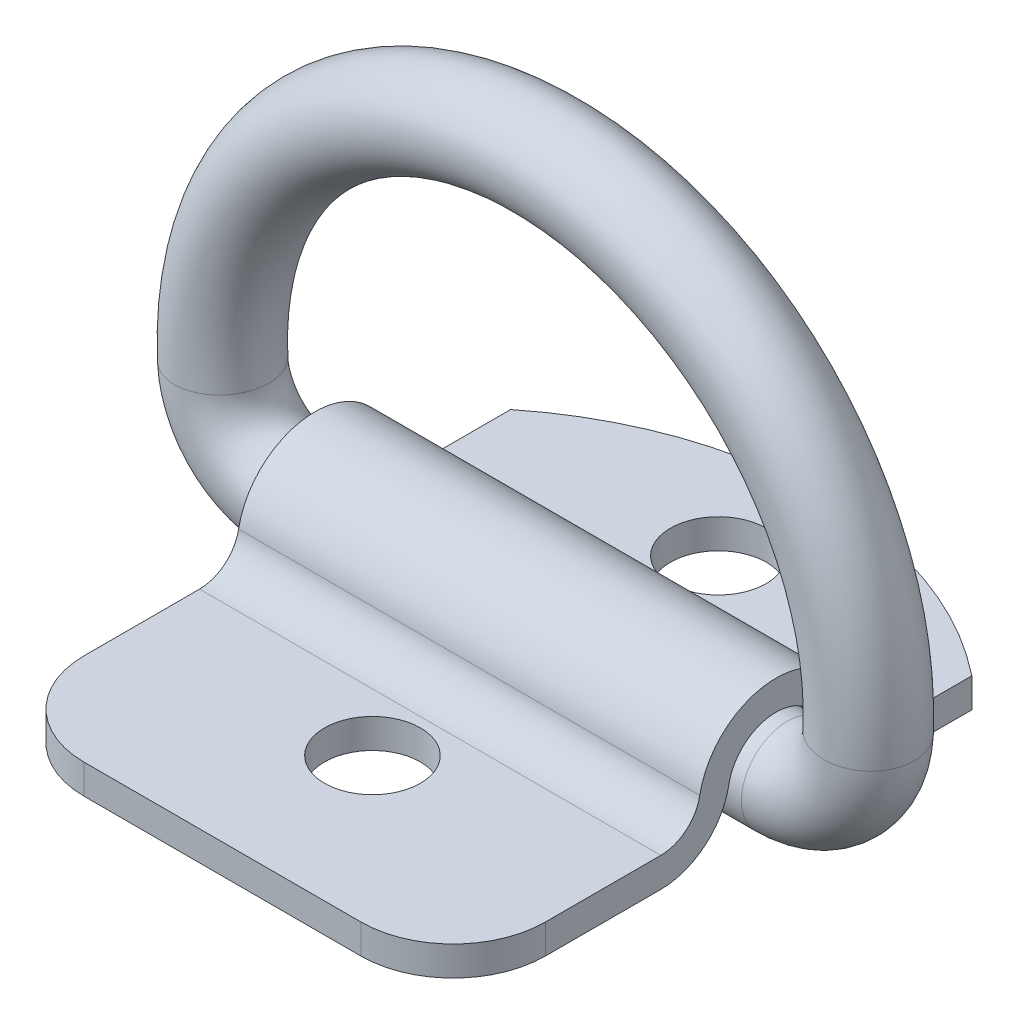
ISO-10303-21;
HEADER;
FILE_DESCRIPTION(('STEP AP214'),'2;1');
FILE_NAME('part.step','',(''),(''),'','','');
FILE_SCHEMA(('AUTOMOTIVE_DESIGN { 1 0 10303 214 1 1 1 1 }'));
ENDSEC;
DATA;
#1=APPLICATION_CONTEXT('core data for automotive mechanical design processes');
#2=APPLICATION_PROTOCOL_DEFINITION('international standard','automotive_design',2000,#1);
#3=PRODUCT_CONTEXT('',#1,'mechanical');
#4=PRODUCT('Part','Part','',(#3));
#5=PRODUCT_RELATED_PRODUCT_CATEGORY('part','',(#4));
#6=PRODUCT_DEFINITION_FORMATION('','',#4);
#7=PRODUCT_DEFINITION_CONTEXT('part definition',#1,'design');
#8=PRODUCT_DEFINITION('design','',#6,#7);
#9=PRODUCT_DEFINITION_SHAPE('','',#8);
#10=(LENGTH_UNIT() NAMED_UNIT(*) SI_UNIT(.MILLI.,.METRE.));
#11=(NAMED_UNIT(*) PLANE_ANGLE_UNIT() SI_UNIT($,.RADIAN.));
#12=(NAMED_UNIT(*) SI_UNIT($,.STERADIAN.) SOLID_ANGLE_UNIT());
#13=UNCERTAINTY_MEASURE_WITH_UNIT(LENGTH_MEASURE(1.E-05),#10,'distance_accuracy_value','');
#14=(GEOMETRIC_REPRESENTATION_CONTEXT(3) GLOBAL_UNCERTAINTY_ASSIGNED_CONTEXT((#13)) GLOBAL_UNIT_ASSIGNED_CONTEXT((#10,
#11,#12)) REPRESENTATION_CONTEXT('',''));
#15=CARTESIAN_POINT('',(0.,0.,0.));
#16=DIRECTION('',(0.,0.,1.));
#17=DIRECTION('',(1.,0.,0.));
#18=AXIS2_PLACEMENT_3D('',#15,#16,#17);
#19=CARTESIAN_POINT('',(15.875,-3.302,22.225));
#20=DIRECTION('',(0.,0.,-1.));
#21=DIRECTION('',(-1.,0.,0.));
#22=AXIS2_PLACEMENT_3D('',#19,#20,#21);
#23=PLANE('',#22);
#24=DIRECTION('',(-1.,0.,0.));
#25=VECTOR('',#24,1.);
#26=CARTESIAN_POINT('',(15.875,-3.302,22.225));
#27=LINE('',#26,#25);
#28=CARTESIAN_POINT('',(9.525,-3.302,22.225));
#29=VERTEX_POINT('',#28);
#30=CARTESIAN_POINT('',(-9.525,-3.302,22.225));
#31=VERTEX_POINT('',#30);
#32=EDGE_CURVE('E175',#29,#31,#27,.T.);
#33=ORIENTED_EDGE('',*,*,#32,.F.);
#34=DIRECTION('',(0.,-1.,0.));
#35=VECTOR('',#34,1.);
#36=CARTESIAN_POINT('',(9.525,31.75,22.225));
#37=LINE('',#36,#35);
#38=CARTESIAN_POINT('',(9.525,-1.27,22.225));
#39=VERTEX_POINT('',#38);
#40=EDGE_CURVE('E245',#39,#29,#37,.T.);
#41=ORIENTED_EDGE('',*,*,#40,.F.);
#42=DIRECTION('',(-1.,0.,0.));
#43=VECTOR('',#42,1.);
#44=CARTESIAN_POINT('',(15.875,-1.27,22.225));
#45=LINE('',#44,#43);
#46=CARTESIAN_POINT('',(-9.525,-1.27,22.225));
#47=VERTEX_POINT('',#46);
#48=EDGE_CURVE('E199',#39,#47,#45,.T.);
#49=ORIENTED_EDGE('',*,*,#48,.T.);
#50=DIRECTION('',(0.,-1.,0.));
#51=VECTOR('',#50,1.);
#52=CARTESIAN_POINT('',(-9.525,31.75,22.225));
#53=LINE('',#52,#51);
#54=EDGE_CURVE('E253',#47,#31,#53,.T.);
#55=ORIENTED_EDGE('',*,*,#54,.T.);
#56=EDGE_LOOP('',(#33,#41,#49,#55));
#57=FACE_BOUND('',#56,.T.);
#58=ADVANCED_FACE('F40',(#57),#23,.F.);
#59=CARTESIAN_POINT('',(15.875,-3.302,22.225));
#60=DIRECTION('',(0.,1.,0.));
#61=DIRECTION('',(0.,0.,1.));
#62=AXIS2_PLACEMENT_3D('',#59,#60,#61);
#63=PLANE('',#62);
#64=CARTESIAN_POINT('',(0.,-3.302,11.90625));
#65=DIRECTION('',(0.,-1.,0.));
#66=DIRECTION('',(0.,0.,-1.));
#67=AXIS2_PLACEMENT_3D('',#64,#65,#66);
#68=CIRCLE('',#67,3.302);
#69=CARTESIAN_POINT('',(0.,-3.302,8.60425));
#70=VERTEX_POINT('',#69);
#71=EDGE_CURVE('E230',#70,#70,#68,.T.);
#72=ORIENTED_EDGE('',*,*,#71,.F.);
#73=EDGE_LOOP('',(#72));
#74=FACE_BOUND('',#73,.T.);
#75=DIRECTION('',(0.,0.,-1.));
#76=VECTOR('',#75,1.);
#77=CARTESIAN_POINT('',(15.875,-3.302,22.225));
#78=LINE('',#77,#76);
#79=CARTESIAN_POINT('',(15.875,-3.302,15.875));
#80=VERTEX_POINT('',#79);
#81=CARTESIAN_POINT('',(15.875,-3.302,7.93114745796597));
#82=VERTEX_POINT('',#81);
#83=EDGE_CURVE('E197',#80,#82,#78,.T.);
#84=ORIENTED_EDGE('',*,*,#83,.F.);
#85=CARTESIAN_POINT('',(9.525,-3.302,15.875));
#86=DIRECTION('',(0.,1.,0.));
#87=DIRECTION('',(0.,0.,1.));
#88=AXIS2_PLACEMENT_3D('',#85,#86,#87);
#89=CIRCLE('',#88,6.35);
#90=EDGE_CURVE('E62',#29,#80,#89,.T.);
#91=ORIENTED_EDGE('',*,*,#90,.F.);
#92=ORIENTED_EDGE('',*,*,#32,.T.);
#93=CARTESIAN_POINT('',(-9.525,-3.302,15.875));
#94=DIRECTION('',(0.,1.,0.));
#95=DIRECTION('',(0.,0.,-1.));
#96=AXIS2_PLACEMENT_3D('',#93,#94,#95);
#97=CIRCLE('',#96,6.35);
#98=CARTESIAN_POINT('',(-15.875,-3.302,15.875));
#99=VERTEX_POINT('',#98);
#100=EDGE_CURVE('E250',#99,#31,#97,.T.);
#101=ORIENTED_EDGE('',*,*,#100,.F.);
#102=DIRECTION('',(0.,0.,-1.));
#103=VECTOR('',#102,1.);
#104=CARTESIAN_POINT('',(-15.875,-3.302,22.225));
#105=LINE('',#104,#103);
#106=CARTESIAN_POINT('',(-15.875,-3.302,7.93114745796597));
#107=VERTEX_POINT('',#106);
#108=EDGE_CURVE('E176',#99,#107,#105,.T.);
#109=ORIENTED_EDGE('',*,*,#108,.T.);
#110=DIRECTION('',(-1.,0.,0.));
#111=VECTOR('',#110,1.);
#112=CARTESIAN_POINT('',(15.875,-3.302,7.93114745796597));
#113=LINE('',#112,#111);
#114=EDGE_CURVE('E221',#82,#107,#113,.T.);
#115=ORIENTED_EDGE('',*,*,#114,.F.);
#116=EDGE_LOOP('',(#84,#91,#92,#101,#109,#115));
#117=FACE_BOUND('',#116,.T.);
#118=ADVANCED_FACE('F42',(#74,#117),#63,.F.);
#119=CARTESIAN_POINT('',(15.875,1.4605,7.93114745796596));
#120=DIRECTION('',(-1.,0.,0.));
#121=DIRECTION('',(0.,0.,1.));
#122=AXIS2_PLACEMENT_3D('',#119,#120,#121);
#123=CYLINDRICAL_SURFACE('',#122,4.7625);
#124=CARTESIAN_POINT('',(-15.875,1.4605,7.93114745796596));
#125=DIRECTION('',(1.,0.,0.));
#126=DIRECTION('',(0.,0.,-1.));
#127=AXIS2_PLACEMENT_3D('',#124,#125,#126);
#128=CIRCLE('',#127,4.7625);
#129=CARTESIAN_POINT('',(-15.875,0.598,3.24739895916717));
#130=VERTEX_POINT('',#129);
#131=EDGE_CURVE('E178',#107,#130,#128,.T.);
#132=ORIENTED_EDGE('',*,*,#131,.T.);
#133=DIRECTION('',(-1.,0.,0.));
#134=VECTOR('',#133,1.);
#135=CARTESIAN_POINT('',(15.875,0.598,3.24739895916717));
#136=LINE('',#135,#134);
#137=CARTESIAN_POINT('',(15.875,0.598,3.24739895916717));
#138=VERTEX_POINT('',#137);
#139=EDGE_CURVE('E218',#138,#130,#136,.T.);
#140=ORIENTED_EDGE('',*,*,#139,.F.);
#141=CARTESIAN_POINT('',(15.875,1.4605,7.93114745796596));
#142=DIRECTION('',(1.,0.,0.));
#143=DIRECTION('',(0.,0.,-1.));
#144=AXIS2_PLACEMENT_3D('',#141,#142,#143);
#145=CIRCLE('',#144,4.7625);
#146=EDGE_CURVE('E259',#82,#138,#145,.T.);
#147=ORIENTED_EDGE('',*,*,#146,.F.);
#148=ORIENTED_EDGE('',*,*,#114,.T.);
#149=EDGE_LOOP('',(#132,#140,#147,#148));
#150=FACE_BOUND('',#149,.T.);
#151=ADVANCED_FACE('F310',(#150),#123,.T.);
#152=CARTESIAN_POINT('',(15.875,0.,0.));
#153=DIRECTION('',(-1.,0.,0.));
#154=DIRECTION('',(0.,0.,1.));
#155=AXIS2_PLACEMENT_3D('',#152,#153,#154);
#156=CYLINDRICAL_SURFACE('',#155,3.302);
#157=CARTESIAN_POINT('',(-15.875,0.,0.));
#158=DIRECTION('',(-1.,0.,0.));
#159=DIRECTION('',(0.,0.,1.));
#160=AXIS2_PLACEMENT_3D('',#157,#158,#159);
#161=CIRCLE('',#160,3.302);
#162=CARTESIAN_POINT('',(-15.875,0.598,-3.24739895916717));
#163=VERTEX_POINT('',#162);
#164=EDGE_CURVE('E181',#130,#163,#161,.T.);
#165=ORIENTED_EDGE('',*,*,#164,.T.);
#166=DIRECTION('',(-1.,0.,0.));
#167=VECTOR('',#166,1.);
#168=CARTESIAN_POINT('',(15.875,0.598,-3.24739895916717));
#169=LINE('',#168,#167);
#170=CARTESIAN_POINT('',(15.875,0.598,-3.24739895916717));
#171=VERTEX_POINT('',#170);
#172=EDGE_CURVE('E215',#171,#163,#169,.T.);
#173=ORIENTED_EDGE('',*,*,#172,.F.);
#174=CARTESIAN_POINT('',(15.875,0.,0.));
#175=DIRECTION('',(-1.,0.,0.));
#176=DIRECTION('',(0.,0.,1.));
#177=AXIS2_PLACEMENT_3D('',#174,#175,#176);
#178=CIRCLE('',#177,3.302);
#179=EDGE_CURVE('E163',#138,#171,#178,.T.);
#180=ORIENTED_EDGE('',*,*,#179,.F.);
#181=ORIENTED_EDGE('',*,*,#139,.T.);
#182=EDGE_LOOP('',(#165,#173,#180,#181));
#183=FACE_BOUND('',#182,.T.);
#184=ADVANCED_FACE('F265',(#183),#156,.F.);
#185=CARTESIAN_POINT('',(15.875,1.4605,-7.93114745796596));
#186=DIRECTION('',(-1.,0.,0.));
#187=DIRECTION('',(0.,0.,1.));
#188=AXIS2_PLACEMENT_3D('',#185,#186,#187);
#189=CYLINDRICAL_SURFACE('',#188,4.7625);
#190=CARTESIAN_POINT('',(-15.875,1.4605,-7.93114745796596));
#191=DIRECTION('',(1.,0.,0.));
#192=DIRECTION('',(0.,0.,1.));
#193=AXIS2_PLACEMENT_3D('',#190,#191,#192);
#194=CIRCLE('',#193,4.7625);
#195=CARTESIAN_POINT('',(-15.875,-3.302,-7.93114745796596));
#196=VERTEX_POINT('',#195);
#197=EDGE_CURVE('E183',#163,#196,#194,.T.);
#198=ORIENTED_EDGE('',*,*,#197,.T.);
#199=DIRECTION('',(-1.,0.,0.));
#200=VECTOR('',#199,1.);
#201=CARTESIAN_POINT('',(15.875,-3.302,-7.93114745796596));
#202=LINE('',#201,#200);
#203=CARTESIAN_POINT('',(15.875,-3.302,-7.93114745796596));
#204=VERTEX_POINT('',#203);
#205=EDGE_CURVE('E213',#204,#196,#202,.T.);
#206=ORIENTED_EDGE('',*,*,#205,.F.);
#207=CARTESIAN_POINT('',(15.875,1.4605,-7.93114745796596));
#208=DIRECTION('',(1.,0.,0.));
#209=DIRECTION('',(0.,0.,1.));
#210=AXIS2_PLACEMENT_3D('',#207,#208,#209);
#211=CIRCLE('',#210,4.7625);
#212=EDGE_CURVE('E157',#171,#204,#211,.T.);
#213=ORIENTED_EDGE('',*,*,#212,.F.);
#214=ORIENTED_EDGE('',*,*,#172,.T.);
#215=EDGE_LOOP('',(#198,#206,#213,#214));
#216=FACE_BOUND('',#215,.T.);
#217=ADVANCED_FACE('F269',(#216),#189,.T.);
#218=CARTESIAN_POINT('',(15.875,-3.302,-19.05));
#219=DIRECTION('',(0.,1.,0.));
#220=DIRECTION('',(0.,0.,1.));
#221=AXIS2_PLACEMENT_3D('',#218,#219,#220);
#222=PLANE('',#221);
#223=CARTESIAN_POINT('',(0.,-3.302,-11.90625));
#224=DIRECTION('',(0.,-1.,0.));
#225=DIRECTION('',(0.,0.,1.));
#226=AXIS2_PLACEMENT_3D('',#223,#224,#225);
#227=CIRCLE('',#226,3.302);
#228=CARTESIAN_POINT('',(0.,-3.302,-8.60425));
#229=VERTEX_POINT('',#228);
#230=EDGE_CURVE('E233',#229,#229,#227,.T.);
#231=ORIENTED_EDGE('',*,*,#230,.F.);
#232=EDGE_LOOP('',(#231));
#233=FACE_BOUND('',#232,.T.);
#234=DIRECTION('',(0.,0.,-1.));
#235=VECTOR('',#234,1.);
#236=CARTESIAN_POINT('',(-15.875,-3.302,-19.05));
#237=LINE('',#236,#235);
#238=CARTESIAN_POINT('',(-15.875,-3.302,-13.4778686449149));
#239=VERTEX_POINT('',#238);
#240=EDGE_CURVE('E153',#196,#239,#237,.T.);
#241=ORIENTED_EDGE('',*,*,#240,.T.);
#242=CARTESIAN_POINT('',(0.,-3.302,6.35));
#243=DIRECTION('',(0.,1.,0.));
#244=DIRECTION('',(0.,0.,1.));
#245=AXIS2_PLACEMENT_3D('',#242,#243,#244);
#246=CIRCLE('',#245,25.4);
#247=CARTESIAN_POINT('',(15.875,-3.302,-13.4778686449149));
#248=VERTEX_POINT('',#247);
#249=EDGE_CURVE('E55',#248,#239,#246,.T.);
#250=ORIENTED_EDGE('',*,*,#249,.F.);
#251=DIRECTION('',(0.,0.,-1.));
#252=VECTOR('',#251,1.);
#253=CARTESIAN_POINT('',(15.875,-3.302,-19.05));
#254=LINE('',#253,#252);
#255=EDGE_CURVE('E151',#204,#248,#254,.T.);
#256=ORIENTED_EDGE('',*,*,#255,.F.);
#257=ORIENTED_EDGE('',*,*,#205,.T.);
#258=EDGE_LOOP('',(#241,#250,#256,#257));
#259=FACE_BOUND('',#258,.T.);
#260=ADVANCED_FACE('F149',(#233,#259),#222,.F.);
#261=CARTESIAN_POINT('',(15.875,-1.27,-19.05));
#262=DIRECTION('',(0.,-1.,0.));
#263=DIRECTION('',(0.,0.,-1.));
#264=AXIS2_PLACEMENT_3D('',#261,#262,#263);
#265=PLANE('',#264);
#266=CARTESIAN_POINT('',(0.,-1.27,-11.90625));
#267=DIRECTION('',(0.,-1.,0.));
#268=DIRECTION('',(0.,0.,-1.));
#269=AXIS2_PLACEMENT_3D('',#266,#267,#268);
#270=CIRCLE('',#269,3.302);
#271=CARTESIAN_POINT('',(0.,-1.27,-15.20825));
#272=VERTEX_POINT('',#271);
#273=EDGE_CURVE('E231',#272,#272,#270,.T.);
#274=ORIENTED_EDGE('',*,*,#273,.T.);
#275=EDGE_LOOP('',(#274));
#276=FACE_BOUND('',#275,.T.);
#277=DIRECTION('',(0.,0.,1.));
#278=VECTOR('',#277,1.);
#279=CARTESIAN_POINT('',(15.875,-1.27,-19.05));
#280=LINE('',#279,#278);
#281=CARTESIAN_POINT('',(15.875,-1.27,-13.4778686449149));
#282=VERTEX_POINT('',#281);
#283=CARTESIAN_POINT('',(15.875,-1.27,-7.93114745796596));
#284=VERTEX_POINT('',#283);
#285=EDGE_CURVE('E159',#282,#284,#280,.T.);
#286=ORIENTED_EDGE('',*,*,#285,.F.);
#287=CARTESIAN_POINT('',(0.,-1.27,6.35));
#288=DIRECTION('',(0.,-1.,0.));
#289=DIRECTION('',(0.,0.,-1.));
#290=AXIS2_PLACEMENT_3D('',#287,#288,#289);
#291=CIRCLE('',#290,25.4);
#292=CARTESIAN_POINT('',(-15.875,-1.27,-13.4778686449149));
#293=VERTEX_POINT('',#292);
#294=EDGE_CURVE('E141',#282,#293,#291,.F.);
#295=ORIENTED_EDGE('',*,*,#294,.T.);
#296=DIRECTION('',(0.,0.,1.));
#297=VECTOR('',#296,1.);
#298=CARTESIAN_POINT('',(-15.875,-1.27,-19.05));
#299=LINE('',#298,#297);
#300=CARTESIAN_POINT('',(-15.875,-1.27,-7.93114745796596));
#301=VERTEX_POINT('',#300);
#302=EDGE_CURVE('E186',#293,#301,#299,.T.);
#303=ORIENTED_EDGE('',*,*,#302,.T.);
#304=DIRECTION('',(-1.,0.,0.));
#305=VECTOR('',#304,1.);
#306=CARTESIAN_POINT('',(15.875,-1.27,-7.93114745796596));
#307=LINE('',#306,#305);
#308=EDGE_CURVE('E210',#284,#301,#307,.T.);
#309=ORIENTED_EDGE('',*,*,#308,.F.);
#310=EDGE_LOOP('',(#286,#295,#303,#309));
#311=FACE_BOUND('',#310,.T.);
#312=ADVANCED_FACE('F275',(#276,#311),#265,.F.);
#313=CARTESIAN_POINT('',(15.875,1.4605,-7.93114745796596));
#314=DIRECTION('',(-1.,0.,0.));
#315=DIRECTION('',(0.,0.,1.));
#316=AXIS2_PLACEMENT_3D('',#313,#314,#315);
#317=CYLINDRICAL_SURFACE('',#316,2.7305);
#318=CARTESIAN_POINT('',(-15.875,1.4605,-7.93114745796596));
#319=DIRECTION('',(-1.,0.,0.));
#320=DIRECTION('',(0.,0.,1.));
#321=AXIS2_PLACEMENT_3D('',#318,#319,#320);
#322=CIRCLE('',#321,2.7305);
#323=CARTESIAN_POINT('',(-15.875,0.966,-5.24579831865466));
#324=VERTEX_POINT('',#323);
#325=EDGE_CURVE('E188',#301,#324,#322,.T.);
#326=ORIENTED_EDGE('',*,*,#325,.T.);
#327=DIRECTION('',(-1.,0.,0.));
#328=VECTOR('',#327,1.);
#329=CARTESIAN_POINT('',(15.875,0.966,-5.24579831865466));
#330=LINE('',#329,#328);
#331=CARTESIAN_POINT('',(15.875,0.966,-5.24579831865466));
#332=VERTEX_POINT('',#331);
#333=EDGE_CURVE('E207',#332,#324,#330,.T.);
#334=ORIENTED_EDGE('',*,*,#333,.F.);
#335=CARTESIAN_POINT('',(15.875,1.4605,-7.93114745796596));
#336=DIRECTION('',(-1.,0.,0.));
#337=DIRECTION('',(0.,0.,1.));
#338=AXIS2_PLACEMENT_3D('',#335,#336,#337);
#339=CIRCLE('',#338,2.7305);
#340=EDGE_CURVE('E161',#284,#332,#339,.T.);
#341=ORIENTED_EDGE('',*,*,#340,.F.);
#342=ORIENTED_EDGE('',*,*,#308,.T.);
#343=EDGE_LOOP('',(#326,#334,#341,#342));
#344=FACE_BOUND('',#343,.T.);
#345=ADVANCED_FACE('F282',(#344),#317,.F.);
#346=CARTESIAN_POINT('',(15.875,0.,0.));
#347=DIRECTION('',(-1.,0.,0.));
#348=DIRECTION('',(0.,0.,1.));
#349=AXIS2_PLACEMENT_3D('',#346,#347,#348);
#350=CYLINDRICAL_SURFACE('',#349,5.334);
#351=CARTESIAN_POINT('',(-15.875,0.,0.));
#352=DIRECTION('',(1.,0.,0.));
#353=DIRECTION('',(0.,0.,1.));
#354=AXIS2_PLACEMENT_3D('',#351,#352,#353);
#355=CIRCLE('',#354,5.334);
#356=CARTESIAN_POINT('',(-15.875,0.966,5.24579831865465));
#357=VERTEX_POINT('',#356);
#358=EDGE_CURVE('E190',#324,#357,#355,.T.);
#359=ORIENTED_EDGE('',*,*,#358,.T.);
#360=DIRECTION('',(-1.,0.,0.));
#361=VECTOR('',#360,1.);
#362=CARTESIAN_POINT('',(15.875,0.966,5.24579831865465));
#363=LINE('',#362,#361);
#364=CARTESIAN_POINT('',(15.875,0.966,5.24579831865465));
#365=VERTEX_POINT('',#364);
#366=EDGE_CURVE('E204',#365,#357,#363,.T.);
#367=ORIENTED_EDGE('',*,*,#366,.F.);
#368=CARTESIAN_POINT('',(15.875,0.,0.));
#369=DIRECTION('',(1.,0.,0.));
#370=DIRECTION('',(0.,0.,1.));
#371=AXIS2_PLACEMENT_3D('',#368,#369,#370);
#372=CIRCLE('',#371,5.334);
#373=EDGE_CURVE('E168',#332,#365,#372,.T.);
#374=ORIENTED_EDGE('',*,*,#373,.F.);
#375=ORIENTED_EDGE('',*,*,#333,.T.);
#376=EDGE_LOOP('',(#359,#367,#374,#375));
#377=FACE_BOUND('',#376,.T.);
#378=ADVANCED_FACE('F285',(#377),#350,.T.);
#379=CARTESIAN_POINT('',(15.875,1.4605,7.93114745796596));
#380=DIRECTION('',(-1.,0.,0.));
#381=DIRECTION('',(0.,0.,1.));
#382=AXIS2_PLACEMENT_3D('',#379,#380,#381);
#383=CYLINDRICAL_SURFACE('',#382,2.7305);
#384=CARTESIAN_POINT('',(-15.875,1.4605,7.93114745796596));
#385=DIRECTION('',(-1.,0.,0.));
#386=DIRECTION('',(0.,0.,-1.));
#387=AXIS2_PLACEMENT_3D('',#384,#385,#386);
#388=CIRCLE('',#387,2.7305);
#389=CARTESIAN_POINT('',(-15.875,-1.27,7.93114745796596));
#390=VERTEX_POINT('',#389);
#391=EDGE_CURVE('E192',#357,#390,#388,.T.);
#392=ORIENTED_EDGE('',*,*,#391,.T.);
#393=DIRECTION('',(-1.,0.,0.));
#394=VECTOR('',#393,1.);
#395=CARTESIAN_POINT('',(15.875,-1.27,7.93114745796596));
#396=LINE('',#395,#394);
#397=CARTESIAN_POINT('',(15.875,-1.27,7.93114745796596));
#398=VERTEX_POINT('',#397);
#399=EDGE_CURVE('E201',#398,#390,#396,.T.);
#400=ORIENTED_EDGE('',*,*,#399,.F.);
#401=CARTESIAN_POINT('',(15.875,1.4605,7.93114745796596));
#402=DIRECTION('',(-1.,0.,0.));
#403=DIRECTION('',(0.,0.,-1.));
#404=AXIS2_PLACEMENT_3D('',#401,#402,#403);
#405=CIRCLE('',#404,2.7305);
#406=EDGE_CURVE('E170',#365,#398,#405,.T.);
#407=ORIENTED_EDGE('',*,*,#406,.F.);
#408=ORIENTED_EDGE('',*,*,#366,.T.);
#409=EDGE_LOOP('',(#392,#400,#407,#408));
#410=FACE_BOUND('',#409,.T.);
#411=ADVANCED_FACE('F290',(#410),#383,.F.);
#412=CARTESIAN_POINT('',(15.875,-1.27,22.225));
#413=DIRECTION('',(0.,-1.,0.));
#414=DIRECTION('',(0.,0.,-1.));
#415=AXIS2_PLACEMENT_3D('',#412,#413,#414);
#416=PLANE('',#415);
#417=CARTESIAN_POINT('',(0.,-1.27,11.90625));
#418=DIRECTION('',(0.,-1.,0.));
#419=DIRECTION('',(0.,0.,-1.));
#420=AXIS2_PLACEMENT_3D('',#417,#418,#419);
#421=CIRCLE('',#420,3.302);
#422=CARTESIAN_POINT('',(0.,-1.27,8.60425));
#423=VERTEX_POINT('',#422);
#424=EDGE_CURVE('E228',#423,#423,#421,.T.);
#425=ORIENTED_EDGE('',*,*,#424,.T.);
#426=EDGE_LOOP('',(#425));
#427=FACE_BOUND('',#426,.T.);
#428=ORIENTED_EDGE('',*,*,#48,.F.);
#429=CARTESIAN_POINT('',(9.525,-1.27,15.875));
#430=DIRECTION('',(0.,-1.,0.));
#431=DIRECTION('',(0.,0.,-1.));
#432=AXIS2_PLACEMENT_3D('',#429,#430,#431);
#433=CIRCLE('',#432,6.35);
#434=CARTESIAN_POINT('',(15.875,-1.27,15.875));
#435=VERTEX_POINT('',#434);
#436=EDGE_CURVE('E247',#39,#435,#433,.F.);
#437=ORIENTED_EDGE('',*,*,#436,.T.);
#438=DIRECTION('',(0.,0.,1.));
#439=VECTOR('',#438,1.);
#440=CARTESIAN_POINT('',(15.875,-1.27,22.225));
#441=LINE('',#440,#439);
#442=EDGE_CURVE('E172',#398,#435,#441,.T.);
#443=ORIENTED_EDGE('',*,*,#442,.F.);
#444=ORIENTED_EDGE('',*,*,#399,.T.);
#445=DIRECTION('',(0.,0.,1.));
#446=VECTOR('',#445,1.);
#447=CARTESIAN_POINT('',(-15.875,-1.27,22.225));
#448=LINE('',#447,#446);
#449=CARTESIAN_POINT('',(-15.875,-1.27,15.875));
#450=VERTEX_POINT('',#449);
#451=EDGE_CURVE('E194',#390,#450,#448,.T.);
#452=ORIENTED_EDGE('',*,*,#451,.T.);
#453=CARTESIAN_POINT('',(-9.525,-1.27,15.875));
#454=DIRECTION('',(0.,-1.,0.));
#455=DIRECTION('',(0.,0.,-1.));
#456=AXIS2_PLACEMENT_3D('',#453,#454,#455);
#457=CIRCLE('',#456,6.35);
#458=EDGE_CURVE('E179',#450,#47,#457,.F.);
#459=ORIENTED_EDGE('',*,*,#458,.T.);
#460=EDGE_LOOP('',(#428,#437,#443,#444,#452,#459));
#461=FACE_BOUND('',#460,.T.);
#462=ADVANCED_FACE('F295',(#427,#461),#416,.F.);
#463=CARTESIAN_POINT('',(15.875,1.4605,7.93114745796596));
#464=DIRECTION('',(1.,0.,0.));
#465=DIRECTION('',(0.,0.,-1.));
#466=AXIS2_PLACEMENT_3D('',#463,#464,#465);
#467=PLANE('',#466);
#468=DIRECTION('',(0.,-1.,0.));
#469=VECTOR('',#468,1.);
#470=CARTESIAN_POINT('',(15.875,31.75,-13.4778686449149));
#471=LINE('',#470,#469);
#472=EDGE_CURVE('E138',#282,#248,#471,.T.);
#473=ORIENTED_EDGE('',*,*,#472,.F.);
#474=ORIENTED_EDGE('',*,*,#285,.T.);
#475=ORIENTED_EDGE('',*,*,#340,.T.);
#476=ORIENTED_EDGE('',*,*,#373,.T.);
#477=ORIENTED_EDGE('',*,*,#406,.T.);
#478=ORIENTED_EDGE('',*,*,#442,.T.);
#479=DIRECTION('',(0.,-1.,0.));
#480=VECTOR('',#479,1.);
#481=CARTESIAN_POINT('',(15.875,31.75,15.875));
#482=LINE('',#481,#480);
#483=EDGE_CURVE('E48',#80,#435,#482,.F.);
#484=ORIENTED_EDGE('',*,*,#483,.F.);
#485=ORIENTED_EDGE('',*,*,#83,.T.);
#486=ORIENTED_EDGE('',*,*,#146,.T.);
#487=ORIENTED_EDGE('',*,*,#179,.T.);
#488=ORIENTED_EDGE('',*,*,#212,.T.);
#489=ORIENTED_EDGE('',*,*,#255,.T.);
#490=EDGE_LOOP('',(#473,#474,#475,#476,#477,#478,#484,#485,#486,#487,#488,#489));
#491=FACE_BOUND('',#490,.T.);
#492=ADVANCED_FACE('F155',(#491),#467,.T.);
#493=CARTESIAN_POINT('',(-15.875,1.4605,7.93114745796596));
#494=DIRECTION('',(1.,0.,0.));
#495=DIRECTION('',(0.,0.,-1.));
#496=AXIS2_PLACEMENT_3D('',#493,#494,#495);
#497=PLANE('',#496);
#498=ORIENTED_EDGE('',*,*,#302,.F.);
#499=DIRECTION('',(0.,-1.,0.));
#500=VECTOR('',#499,1.);
#501=CARTESIAN_POINT('',(-15.875,31.75,-13.4778686449149));
#502=LINE('',#501,#500);
#503=EDGE_CURVE('E12',#293,#239,#502,.T.);
#504=ORIENTED_EDGE('',*,*,#503,.T.);
#505=ORIENTED_EDGE('',*,*,#240,.F.);
#506=ORIENTED_EDGE('',*,*,#197,.F.);
#507=ORIENTED_EDGE('',*,*,#164,.F.);
#508=ORIENTED_EDGE('',*,*,#131,.F.);
#509=ORIENTED_EDGE('',*,*,#108,.F.);
#510=DIRECTION('',(0.,-1.,0.));
#511=VECTOR('',#510,1.);
#512=CARTESIAN_POINT('',(-15.875,31.75,15.875));
#513=LINE('',#512,#511);
#514=EDGE_CURVE('E224',#99,#450,#513,.F.);
#515=ORIENTED_EDGE('',*,*,#514,.T.);
#516=ORIENTED_EDGE('',*,*,#451,.F.);
#517=ORIENTED_EDGE('',*,*,#391,.F.);
#518=ORIENTED_EDGE('',*,*,#358,.F.);
#519=ORIENTED_EDGE('',*,*,#325,.F.);
#520=EDGE_LOOP('',(#498,#504,#505,#506,#507,#508,#509,#515,#516,#517,#518,#519));
#521=FACE_BOUND('',#520,.T.);
#522=ADVANCED_FACE('F272',(#521),#497,.F.);
#523=CARTESIAN_POINT('',(-9.525,31.75,15.875));
#524=DIRECTION('',(0.,-1.,0.));
#525=DIRECTION('',(0.,0.,-1.));
#526=AXIS2_PLACEMENT_3D('',#523,#524,#525);
#527=CYLINDRICAL_SURFACE('',#526,6.35);
#528=ORIENTED_EDGE('',*,*,#514,.F.);
#529=ORIENTED_EDGE('',*,*,#100,.T.);
#530=ORIENTED_EDGE('',*,*,#54,.F.);
#531=ORIENTED_EDGE('',*,*,#458,.F.);
#532=EDGE_LOOP('',(#528,#529,#530,#531));
#533=FACE_BOUND('',#532,.T.);
#534=ADVANCED_FACE('F306',(#533),#527,.T.);
#535=CARTESIAN_POINT('',(9.525,31.75,15.875));
#536=DIRECTION('',(0.,-1.,0.));
#537=DIRECTION('',(0.,0.,-1.));
#538=AXIS2_PLACEMENT_3D('',#535,#536,#537);
#539=CYLINDRICAL_SURFACE('',#538,6.35);
#540=ORIENTED_EDGE('',*,*,#40,.T.);
#541=ORIENTED_EDGE('',*,*,#90,.T.);
#542=ORIENTED_EDGE('',*,*,#483,.T.);
#543=ORIENTED_EDGE('',*,*,#436,.F.);
#544=EDGE_LOOP('',(#540,#541,#542,#543));
#545=FACE_BOUND('',#544,.T.);
#546=ADVANCED_FACE('F298',(#545),#539,.T.);
#547=CARTESIAN_POINT('',(0.,31.75,11.90625));
#548=DIRECTION('',(0.,-1.,0.));
#549=DIRECTION('',(0.,0.,-1.));
#550=AXIS2_PLACEMENT_3D('',#547,#548,#549);
#551=CYLINDRICAL_SURFACE('',#550,3.302);
#552=ORIENTED_EDGE('',*,*,#71,.T.);
#553=EDGE_LOOP('',(#552));
#554=FACE_BOUND('',#553,.T.);
#555=ORIENTED_EDGE('',*,*,#424,.F.);
#556=EDGE_LOOP('',(#555));
#557=FACE_BOUND('',#556,.T.);
#558=ADVANCED_FACE('F391',(#554,#557),#551,.F.);
#559=CARTESIAN_POINT('',(0.,31.75,-11.90625));
#560=DIRECTION('',(0.,-1.,0.));
#561=DIRECTION('',(0.,0.,-1.));
#562=AXIS2_PLACEMENT_3D('',#559,#560,#561);
#563=CYLINDRICAL_SURFACE('',#562,3.302);
#564=ORIENTED_EDGE('',*,*,#230,.T.);
#565=EDGE_LOOP('',(#564));
#566=FACE_BOUND('',#565,.T.);
#567=ORIENTED_EDGE('',*,*,#273,.F.);
#568=EDGE_LOOP('',(#567));
#569=FACE_BOUND('',#568,.T.);
#570=ADVANCED_FACE('F398',(#566,#569),#563,.F.);
#571=CARTESIAN_POINT('',(0.,31.75,6.35));
#572=DIRECTION('',(0.,-1.,0.));
#573=DIRECTION('',(0.,0.,-1.));
#574=AXIS2_PLACEMENT_3D('',#571,#572,#573);
#575=CYLINDRICAL_SURFACE('',#574,25.4);
#576=ORIENTED_EDGE('',*,*,#249,.T.);
#577=ORIENTED_EDGE('',*,*,#503,.F.);
#578=ORIENTED_EDGE('',*,*,#294,.F.);
#579=ORIENTED_EDGE('',*,*,#472,.T.);
#580=EDGE_LOOP('',(#576,#577,#578,#579));
#581=FACE_BOUND('',#580,.T.);
#582=ADVANCED_FACE('F139',(#581),#575,.T.);
#583=CLOSED_SHELL('',(#58,#118,#151,#184,#217,#260,#312,#345,#378,#411,#462,#492,#522,#534,#546,
#558,#570,#582));
#584=MANIFOLD_SOLID_BREP('B2',#583);
#585=CARTESIAN_POINT('',(16.66875,5.55625,0.));
#586=DIRECTION('',(0.,0.,-1.));
#587=DIRECTION('',(-1.,0.,0.));
#588=AXIS2_PLACEMENT_3D('',#585,#586,#587);
#589=TOROIDAL_SURFACE('',#588,5.55625,3.175);
#590=CARTESIAN_POINT('',(22.2189932432432,5.29795945945914,0.));
#591=DIRECTION('',(0.0464864864865049,0.998918918918918,0.));
#592=DIRECTION('',(0.,0.,-1.));
#593=AXIS2_PLACEMENT_3D('',#590,#591,#592);
#594=CIRCLE('',#593,3.175);
#595=CARTESIAN_POINT('',(25.3905608108108,5.15036486486436,0.));
#596=VERTEX_POINT('',#595);
#597=EDGE_CURVE('E471',#596,#596,#594,.T.);
#598=CARTESIAN_POINT('',(16.6687499999997,0.,0.));
#599=DIRECTION('',(1.,0.,0.));
#600=DIRECTION('',(0.,0.,-1.));
#601=AXIS2_PLACEMENT_3D('',#598,#599,#600);
#602=CIRCLE('',#601,3.175);
#603=CARTESIAN_POINT('',(16.6687499999995,-3.175,0.));
#604=VERTEX_POINT('',#603);
#605=EDGE_CURVE('E39',#604,#604,#602,.T.);
#606=CARTESIAN_POINT('',(16.66875,5.55625,0.));
#607=DIRECTION('',(0.,0.,-1.));
#608=DIRECTION('',(-1.,0.,0.));
#609=AXIS2_PLACEMENT_3D('',#606,#607,#608);
#610=CIRCLE('',#609,8.73125);
#611=EDGE_CURVE('',#596,#604,#610,.T.);
#612=ORIENTED_EDGE('',*,*,#597,.F.);
#613=ORIENTED_EDGE('',*,*,#605,.T.);
#614=ORIENTED_EDGE('',*,*,#611,.T.);
#615=ORIENTED_EDGE('',*,*,#611,.F.);
#616=EDGE_LOOP('',(#612,#614,#613,#615));
#617=FACE_BOUND('',#616,.T.);
#618=ADVANCED_FACE('F465',(#617),#589,.T.);
#619=CARTESIAN_POINT('',(0.,6.33196022727274,0.));
#620=DIRECTION('',(0.,0.,-1.));
#621=DIRECTION('',(-1.,0.,0.));
#622=AXIS2_PLACEMENT_3D('',#619,#620,#621);
#623=TOROIDAL_SURFACE('',#622,22.2430397727273,3.175);
#624=CARTESIAN_POINT('',(-22.2189932432432,5.29795945945948,0.));
#625=DIRECTION('',(0.046486486486483,-0.998918918918919,0.));
#626=DIRECTION('',(0.,0.,-1.));
#627=AXIS2_PLACEMENT_3D('',#624,#625,#626);
#628=CIRCLE('',#627,3.175);
#629=CARTESIAN_POINT('',(-25.3905608108108,5.15036486486488,0.));
#630=VERTEX_POINT('',#629);
#631=EDGE_CURVE('E475',#630,#630,#628,.T.);
#632=CARTESIAN_POINT('',(0.,6.33196022727274,0.));
#633=DIRECTION('',(0.,0.,-1.));
#634=DIRECTION('',(-1.,0.,0.));
#635=AXIS2_PLACEMENT_3D('',#632,#633,#634);
#636=CIRCLE('',#635,25.4180397727273);
#637=EDGE_CURVE('',#630,#596,#636,.T.);
#638=ORIENTED_EDGE('',*,*,#631,.F.);
#639=ORIENTED_EDGE('',*,*,#597,.T.);
#640=ORIENTED_EDGE('',*,*,#637,.T.);
#641=ORIENTED_EDGE('',*,*,#637,.F.);
#642=EDGE_LOOP('',(#638,#640,#639,#641));
#643=FACE_BOUND('',#642,.T.);
#644=ADVANCED_FACE('F491',(#643),#623,.T.);
#645=CARTESIAN_POINT('',(-16.66875,5.55625,0.));
#646=DIRECTION('',(0.,0.,-1.));
#647=DIRECTION('',(-1.,0.,0.));
#648=AXIS2_PLACEMENT_3D('',#645,#646,#647);
#649=TOROIDAL_SURFACE('',#648,5.55625,3.175);
#650=CARTESIAN_POINT('',(-16.66875,0.,0.));
#651=DIRECTION('',(1.,0.,0.));
#652=DIRECTION('',(0.,0.,-1.));
#653=AXIS2_PLACEMENT_3D('',#650,#651,#652);
#654=CIRCLE('',#653,3.175);
#655=CARTESIAN_POINT('',(-16.66875,-3.175,0.));
#656=VERTEX_POINT('',#655);
#657=EDGE_CURVE('E479',#656,#656,#654,.T.);
#658=CARTESIAN_POINT('',(-16.66875,5.55625,0.));
#659=DIRECTION('',(0.,0.,-1.));
#660=DIRECTION('',(-1.,0.,0.));
#661=AXIS2_PLACEMENT_3D('',#658,#659,#660);
#662=CIRCLE('',#661,8.73125);
#663=EDGE_CURVE('',#656,#630,#662,.T.);
#664=ORIENTED_EDGE('',*,*,#657,.F.);
#665=ORIENTED_EDGE('',*,*,#631,.T.);
#666=ORIENTED_EDGE('',*,*,#663,.T.);
#667=ORIENTED_EDGE('',*,*,#663,.F.);
#668=EDGE_LOOP('',(#664,#666,#665,#667));
#669=FACE_BOUND('',#668,.T.);
#670=ADVANCED_FACE('F488',(#669),#649,.T.);
#671=CARTESIAN_POINT('',(-16.66875,0.,0.));
#672=DIRECTION('',(1.,0.,0.));
#673=DIRECTION('',(0.,0.,-1.));
#674=AXIS2_PLACEMENT_3D('',#671,#672,#673);
#675=CYLINDRICAL_SURFACE('',#674,3.175);
#676=ORIENTED_EDGE('',*,*,#657,.T.);
#677=EDGE_LOOP('',(#676));
#678=FACE_BOUND('',#677,.T.);
#679=ORIENTED_EDGE('',*,*,#605,.F.);
#680=EDGE_LOOP('',(#679));
#681=FACE_BOUND('',#680,.T.);
#682=ADVANCED_FACE('F485',(#678,#681),#675,.T.);
#683=CLOSED_SHELL('',(#618,#644,#670,#682));
#684=MANIFOLD_SOLID_BREP('B6',#683);
#685=ADVANCED_BREP_SHAPE_REPRESENTATION('',(#18,#584,#684),#14);
#686=SHAPE_DEFINITION_REPRESENTATION(#9,#685);
ENDSEC;
END-ISO-10303-21;
